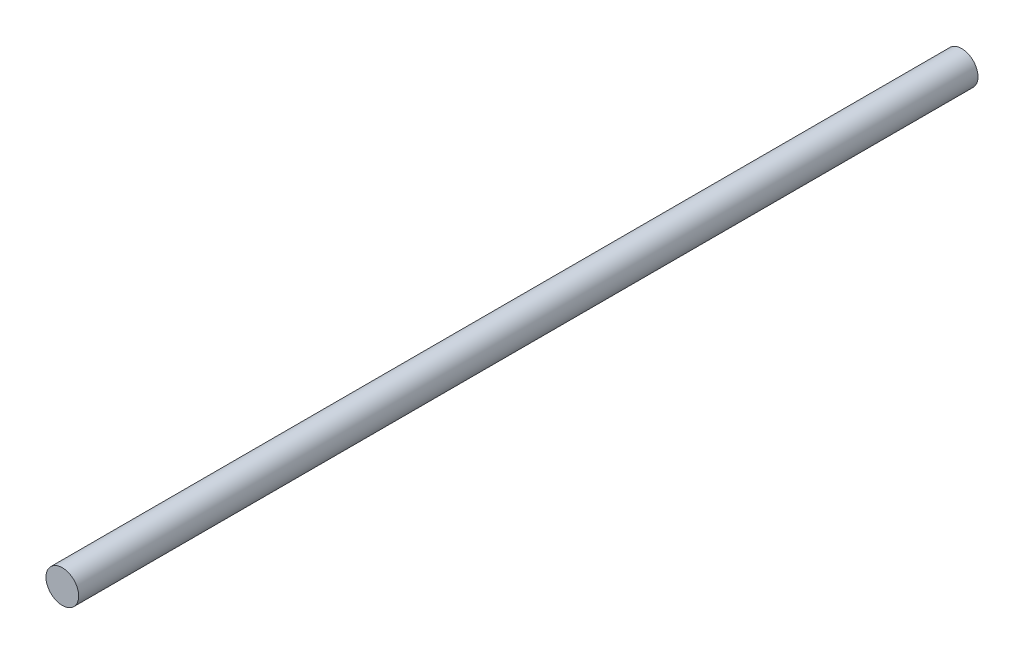
ISO-10303-21;
HEADER;
FILE_DESCRIPTION(('STEP AP214'),'2;1');
FILE_NAME('part.step','',(''),(''),'','','');
FILE_SCHEMA(('AUTOMOTIVE_DESIGN { 1 0 10303 214 1 1 1 1 }'));
ENDSEC;
DATA;
#1=APPLICATION_CONTEXT('core data for automotive mechanical design processes');
#2=APPLICATION_PROTOCOL_DEFINITION('international standard','automotive_design',2000,#1);
#3=PRODUCT_CONTEXT('',#1,'mechanical');
#4=PRODUCT('Part','Part','',(#3));
#5=PRODUCT_RELATED_PRODUCT_CATEGORY('part','',(#4));
#6=PRODUCT_DEFINITION_FORMATION('','',#4);
#7=PRODUCT_DEFINITION_CONTEXT('part definition',#1,'design');
#8=PRODUCT_DEFINITION('design','',#6,#7);
#9=PRODUCT_DEFINITION_SHAPE('','',#8);
#10=(LENGTH_UNIT() NAMED_UNIT(*) SI_UNIT(.MILLI.,.METRE.));
#11=(NAMED_UNIT(*) PLANE_ANGLE_UNIT() SI_UNIT($,.RADIAN.));
#12=(NAMED_UNIT(*) SI_UNIT($,.STERADIAN.) SOLID_ANGLE_UNIT());
#13=UNCERTAINTY_MEASURE_WITH_UNIT(LENGTH_MEASURE(1.E-05),#10,'distance_accuracy_value','');
#14=(GEOMETRIC_REPRESENTATION_CONTEXT(3) GLOBAL_UNCERTAINTY_ASSIGNED_CONTEXT((#13)) GLOBAL_UNIT_ASSIGNED_CONTEXT((#10,
#11,#12)) REPRESENTATION_CONTEXT('',''));
#15=CARTESIAN_POINT('',(0.,0.,0.));
#16=DIRECTION('',(0.,0.,1.));
#17=DIRECTION('',(1.,0.,0.));
#18=AXIS2_PLACEMENT_3D('',#15,#16,#17);
#19=CARTESIAN_POINT('',(0.,0.,220.));
#20=DIRECTION('',(0.,0.,-1.));
#21=DIRECTION('',(-1.,0.,0.));
#22=AXIS2_PLACEMENT_3D('',#19,#20,#21);
#23=CYLINDRICAL_SURFACE('',#22,4.);
#24=CARTESIAN_POINT('',(0.,0.,220.));
#25=DIRECTION('',(0.,0.,1.));
#26=DIRECTION('',(1.,0.,0.));
#27=AXIS2_PLACEMENT_3D('',#24,#25,#26);
#28=CIRCLE('',#27,4.);
#29=CARTESIAN_POINT('',(4.,0.,220.));
#30=VERTEX_POINT('',#29);
#31=EDGE_CURVE('E10',#30,#30,#28,.T.);
#32=ORIENTED_EDGE('',*,*,#31,.F.);
#33=EDGE_LOOP('',(#32));
#34=FACE_BOUND('',#33,.T.);
#35=CARTESIAN_POINT('',(0.,0.,0.));
#36=DIRECTION('',(0.,0.,1.));
#37=DIRECTION('',(1.,0.,0.));
#38=AXIS2_PLACEMENT_3D('',#35,#36,#37);
#39=CIRCLE('',#38,4.);
#40=CARTESIAN_POINT('',(4.,0.,0.));
#41=VERTEX_POINT('',#40);
#42=EDGE_CURVE('E33',#41,#41,#39,.T.);
#43=ORIENTED_EDGE('',*,*,#42,.T.);
#44=EDGE_LOOP('',(#43));
#45=FACE_BOUND('',#44,.T.);
#46=ADVANCED_FACE('F30',(#34,#45),#23,.T.);
#47=CARTESIAN_POINT('',(0.,0.,220.));
#48=DIRECTION('',(0.,0.,1.));
#49=DIRECTION('',(1.,0.,0.));
#50=AXIS2_PLACEMENT_3D('',#47,#48,#49);
#51=PLANE('',#50);
#52=ORIENTED_EDGE('',*,*,#31,.T.);
#53=EDGE_LOOP('',(#52));
#54=FACE_BOUND('',#53,.T.);
#55=ADVANCED_FACE('F45',(#54),#51,.T.);
#56=CARTESIAN_POINT('',(0.,0.,0.));
#57=DIRECTION('',(0.,0.,1.));
#58=DIRECTION('',(1.,0.,0.));
#59=AXIS2_PLACEMENT_3D('',#56,#57,#58);
#60=PLANE('',#59);
#61=ORIENTED_EDGE('',*,*,#42,.F.);
#62=EDGE_LOOP('',(#61));
#63=FACE_BOUND('',#62,.T.);
#64=ADVANCED_FACE('F43',(#63),#60,.F.);
#65=CLOSED_SHELL('',(#46,#55,#64));
#66=MANIFOLD_SOLID_BREP('B2',#65);
#67=ADVANCED_BREP_SHAPE_REPRESENTATION('',(#18,#66),#14);
#68=SHAPE_DEFINITION_REPRESENTATION(#9,#67);
ENDSEC;
END-ISO-10303-21;
